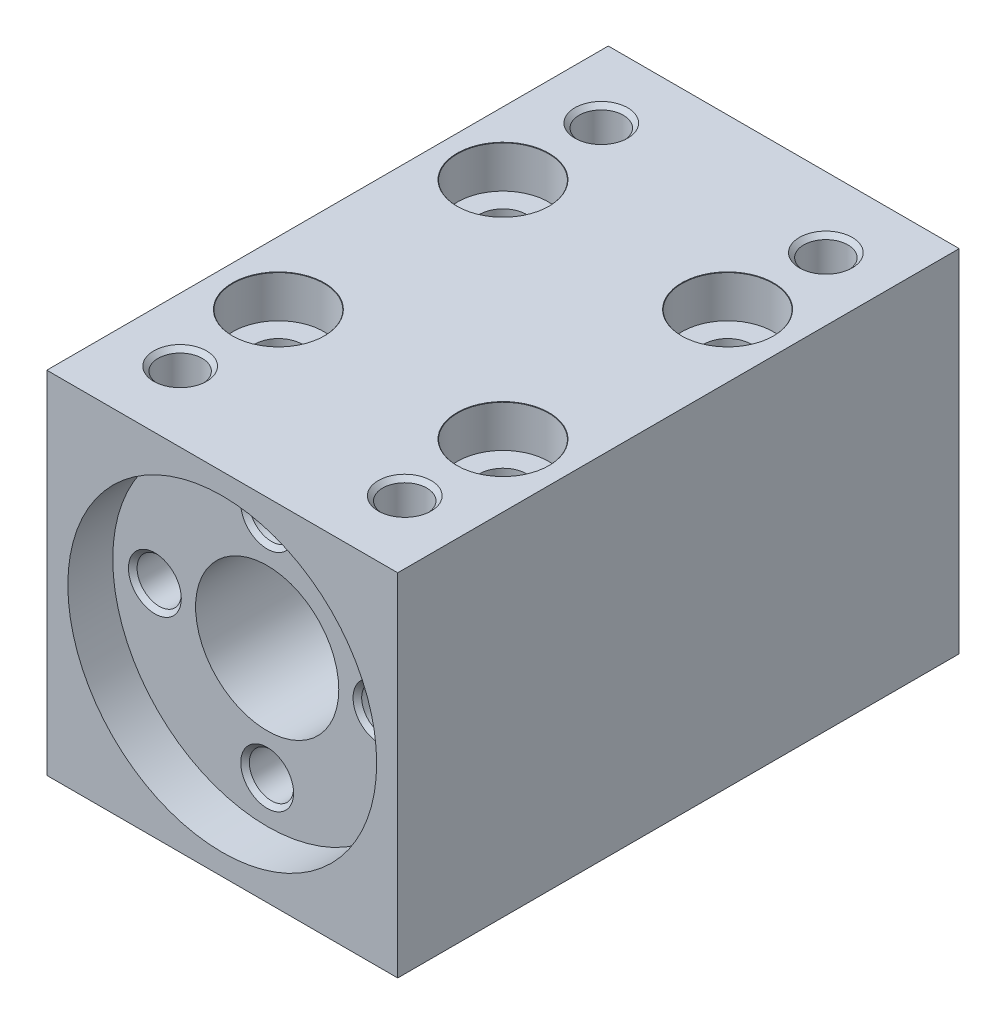
ISO-10303-21;
HEADER;
FILE_DESCRIPTION(('STEP AP214'),'2;1');
FILE_NAME('part.step','',(''),(''),'','','');
FILE_SCHEMA(('AUTOMOTIVE_DESIGN { 1 0 10303 214 1 1 1 1 }'));
ENDSEC;
DATA;
#1=APPLICATION_CONTEXT('core data for automotive mechanical design processes');
#2=APPLICATION_PROTOCOL_DEFINITION('international standard','automotive_design',2000,#1);
#3=PRODUCT_CONTEXT('',#1,'mechanical');
#4=PRODUCT('Part','Part','',(#3));
#5=PRODUCT_RELATED_PRODUCT_CATEGORY('part','',(#4));
#6=PRODUCT_DEFINITION_FORMATION('','',#4);
#7=PRODUCT_DEFINITION_CONTEXT('part definition',#1,'design');
#8=PRODUCT_DEFINITION('design','',#6,#7);
#9=PRODUCT_DEFINITION_SHAPE('','',#8);
#10=(LENGTH_UNIT() NAMED_UNIT(*) SI_UNIT(.MILLI.,.METRE.));
#11=(NAMED_UNIT(*) PLANE_ANGLE_UNIT() SI_UNIT($,.RADIAN.));
#12=(NAMED_UNIT(*) SI_UNIT($,.STERADIAN.) SOLID_ANGLE_UNIT());
#13=UNCERTAINTY_MEASURE_WITH_UNIT(LENGTH_MEASURE(1.E-05),#10,'distance_accuracy_value','');
#14=(GEOMETRIC_REPRESENTATION_CONTEXT(3) GLOBAL_UNCERTAINTY_ASSIGNED_CONTEXT((#13)) GLOBAL_UNIT_ASSIGNED_CONTEXT((#10,
#11,#12)) REPRESENTATION_CONTEXT('',''));
#15=CARTESIAN_POINT('',(0.,0.,0.));
#16=DIRECTION('',(0.,0.,1.));
#17=DIRECTION('',(1.,0.,0.));
#18=AXIS2_PLACEMENT_3D('',#15,#16,#17);
#19=CARTESIAN_POINT('',(0.,0.,0.));
#20=DIRECTION('',(0.,0.,1.));
#21=DIRECTION('',(1.,0.,0.));
#22=AXIS2_PLACEMENT_3D('',#19,#20,#21);
#23=CYLINDRICAL_SURFACE('',#22,5.1);
#24=CARTESIAN_POINT('',(0.,0.,0.));
#25=DIRECTION('',(0.,0.,1.));
#26=DIRECTION('',(1.,0.,0.));
#27=AXIS2_PLACEMENT_3D('',#24,#25,#26);
#28=CIRCLE('',#27,5.1);
#29=CARTESIAN_POINT('',(5.1,0.,0.));
#30=VERTEX_POINT('',#29);
#31=EDGE_CURVE('E308',#30,#30,#28,.T.);
#32=ORIENTED_EDGE('',*,*,#31,.F.);
#33=EDGE_LOOP('',(#32));
#34=FACE_BOUND('',#33,.T.);
#35=CARTESIAN_POINT('',(0.,0.,36.8));
#36=DIRECTION('',(0.,0.,1.));
#37=DIRECTION('',(1.,0.,0.));
#38=AXIS2_PLACEMENT_3D('',#35,#36,#37);
#39=CIRCLE('',#38,5.1);
#40=CARTESIAN_POINT('',(5.1,0.,36.8));
#41=VERTEX_POINT('',#40);
#42=EDGE_CURVE('E46',#41,#41,#39,.F.);
#43=ORIENTED_EDGE('',*,*,#42,.F.);
#44=EDGE_LOOP('',(#43));
#45=FACE_BOUND('',#44,.T.);
#46=ADVANCED_FACE('F42',(#34,#45),#23,.F.);
#47=CARTESIAN_POINT('',(-12.5,-12.5,40.));
#48=DIRECTION('',(1.,0.,0.));
#49=DIRECTION('',(0.,0.,-1.));
#50=AXIS2_PLACEMENT_3D('',#47,#48,#49);
#51=PLANE('',#50);
#52=DIRECTION('',(0.,-1.,0.));
#53=VECTOR('',#52,1.);
#54=CARTESIAN_POINT('',(-12.5,-12.5,0.));
#55=LINE('',#54,#53);
#56=CARTESIAN_POINT('',(-12.5,12.5,0.));
#57=VERTEX_POINT('',#56);
#58=CARTESIAN_POINT('',(-12.5,-12.5,0.));
#59=VERTEX_POINT('',#58);
#60=EDGE_CURVE('E312',#57,#59,#55,.T.);
#61=ORIENTED_EDGE('',*,*,#60,.T.);
#62=DIRECTION('',(0.,0.,-1.));
#63=VECTOR('',#62,1.);
#64=CARTESIAN_POINT('',(-12.5,-12.5,40.));
#65=LINE('',#64,#63);
#66=CARTESIAN_POINT('',(-12.5,-12.5,40.));
#67=VERTEX_POINT('',#66);
#68=EDGE_CURVE('E11',#67,#59,#65,.T.);
#69=ORIENTED_EDGE('',*,*,#68,.F.);
#70=DIRECTION('',(0.,-1.,0.));
#71=VECTOR('',#70,1.);
#72=CARTESIAN_POINT('',(-12.5,-12.5,40.));
#73=LINE('',#72,#71);
#74=CARTESIAN_POINT('',(-12.5,12.5,40.));
#75=VERTEX_POINT('',#74);
#76=EDGE_CURVE('E313',#75,#67,#73,.T.);
#77=ORIENTED_EDGE('',*,*,#76,.F.);
#78=DIRECTION('',(0.,0.,-1.));
#79=VECTOR('',#78,1.);
#80=CARTESIAN_POINT('',(-12.5,12.5,40.));
#81=LINE('',#80,#79);
#82=EDGE_CURVE('E323',#75,#57,#81,.T.);
#83=ORIENTED_EDGE('',*,*,#82,.T.);
#84=EDGE_LOOP('',(#61,#69,#77,#83));
#85=FACE_BOUND('',#84,.T.);
#86=ADVANCED_FACE('F44',(#85),#51,.F.);
#87=CARTESIAN_POINT('',(12.5,-12.5,40.));
#88=DIRECTION('',(0.,1.,0.));
#89=DIRECTION('',(-1.,0.,0.));
#90=AXIS2_PLACEMENT_3D('',#87,#88,#89);
#91=PLANE('',#90);
#92=CARTESIAN_POINT('',(-8.,-12.5,12.));
#93=DIRECTION('',(0.,1.,0.));
#94=DIRECTION('',(0.,0.,1.));
#95=AXIS2_PLACEMENT_3D('',#92,#93,#94);
#96=CIRCLE('',#95,1.69999999999999);
#97=CARTESIAN_POINT('',(-8.,-12.5,13.7));
#98=VERTEX_POINT('',#97);
#99=EDGE_CURVE('E188',#98,#98,#96,.T.);
#100=ORIENTED_EDGE('',*,*,#99,.T.);
#101=EDGE_LOOP('',(#100));
#102=FACE_BOUND('',#101,.T.);
#103=CARTESIAN_POINT('',(8.,-12.5,12.));
#104=DIRECTION('',(0.,1.,0.));
#105=DIRECTION('',(0.,0.,1.));
#106=AXIS2_PLACEMENT_3D('',#103,#104,#105);
#107=CIRCLE('',#106,1.69999999999999);
#108=CARTESIAN_POINT('',(8.,-12.5,13.7));
#109=VERTEX_POINT('',#108);
#110=EDGE_CURVE('E208',#109,#109,#107,.T.);
#111=ORIENTED_EDGE('',*,*,#110,.T.);
#112=EDGE_LOOP('',(#111));
#113=FACE_BOUND('',#112,.T.);
#114=CARTESIAN_POINT('',(-8.,-12.5,28.));
#115=DIRECTION('',(0.,1.,0.));
#116=DIRECTION('',(0.,0.,1.));
#117=AXIS2_PLACEMENT_3D('',#114,#115,#116);
#118=CIRCLE('',#117,1.69999999999999);
#119=CARTESIAN_POINT('',(-8.,-12.5,29.7));
#120=VERTEX_POINT('',#119);
#121=EDGE_CURVE('E228',#120,#120,#118,.T.);
#122=ORIENTED_EDGE('',*,*,#121,.T.);
#123=EDGE_LOOP('',(#122));
#124=FACE_BOUND('',#123,.T.);
#125=CARTESIAN_POINT('',(8.,-12.5,28.));
#126=DIRECTION('',(0.,1.,0.));
#127=DIRECTION('',(0.,0.,1.));
#128=AXIS2_PLACEMENT_3D('',#125,#126,#127);
#129=CIRCLE('',#128,1.69999999999999);
#130=CARTESIAN_POINT('',(8.,-12.5,29.7));
#131=VERTEX_POINT('',#130);
#132=EDGE_CURVE('E248',#131,#131,#129,.T.);
#133=ORIENTED_EDGE('',*,*,#132,.T.);
#134=EDGE_LOOP('',(#133));
#135=FACE_BOUND('',#134,.T.);
#136=DIRECTION('',(1.,0.,0.));
#137=VECTOR('',#136,1.);
#138=CARTESIAN_POINT('',(12.5,-12.5,0.));
#139=LINE('',#138,#137);
#140=CARTESIAN_POINT('',(12.5,-12.5,0.));
#141=VERTEX_POINT('',#140);
#142=EDGE_CURVE('E327',#59,#141,#139,.T.);
#143=ORIENTED_EDGE('',*,*,#142,.T.);
#144=DIRECTION('',(0.,0.,-1.));
#145=VECTOR('',#144,1.);
#146=CARTESIAN_POINT('',(12.5,-12.5,40.));
#147=LINE('',#146,#145);
#148=CARTESIAN_POINT('',(12.5,-12.5,40.));
#149=VERTEX_POINT('',#148);
#150=EDGE_CURVE('E53',#149,#141,#147,.T.);
#151=ORIENTED_EDGE('',*,*,#150,.F.);
#152=DIRECTION('',(1.,0.,0.));
#153=VECTOR('',#152,1.);
#154=CARTESIAN_POINT('',(12.5,-12.5,40.));
#155=LINE('',#154,#153);
#156=EDGE_CURVE('E92',#67,#149,#155,.T.);
#157=ORIENTED_EDGE('',*,*,#156,.F.);
#158=ORIENTED_EDGE('',*,*,#68,.T.);
#159=EDGE_LOOP('',(#143,#151,#157,#158));
#160=FACE_BOUND('',#159,.T.);
#161=ADVANCED_FACE('F361',(#102,#113,#124,#135,#160),#91,.F.);
#162=CARTESIAN_POINT('',(12.5,-12.5,40.));
#163=DIRECTION('',(-1.,0.,0.));
#164=DIRECTION('',(0.,0.,1.));
#165=AXIS2_PLACEMENT_3D('',#162,#163,#164);
#166=PLANE('',#165);
#167=DIRECTION('',(0.,1.,0.));
#168=VECTOR('',#167,1.);
#169=CARTESIAN_POINT('',(12.5,-12.5,0.));
#170=LINE('',#169,#168);
#171=CARTESIAN_POINT('',(12.5,12.5,0.));
#172=VERTEX_POINT('',#171);
#173=EDGE_CURVE('E79',#141,#172,#170,.T.);
#174=ORIENTED_EDGE('',*,*,#173,.T.);
#175=DIRECTION('',(0.,0.,-1.));
#176=VECTOR('',#175,1.);
#177=CARTESIAN_POINT('',(12.5,12.5,40.));
#178=LINE('',#177,#176);
#179=CARTESIAN_POINT('',(12.5,12.5,40.));
#180=VERTEX_POINT('',#179);
#181=EDGE_CURVE('E336',#180,#172,#178,.T.);
#182=ORIENTED_EDGE('',*,*,#181,.F.);
#183=DIRECTION('',(0.,1.,0.));
#184=VECTOR('',#183,1.);
#185=CARTESIAN_POINT('',(12.5,-12.5,40.));
#186=LINE('',#185,#184);
#187=EDGE_CURVE('E318',#149,#180,#186,.T.);
#188=ORIENTED_EDGE('',*,*,#187,.F.);
#189=ORIENTED_EDGE('',*,*,#150,.T.);
#190=EDGE_LOOP('',(#174,#182,#188,#189));
#191=FACE_BOUND('',#190,.T.);
#192=ADVANCED_FACE('F341',(#191),#166,.F.);
#193=CARTESIAN_POINT('',(12.5,12.5,40.));
#194=DIRECTION('',(0.,-1.,0.));
#195=DIRECTION('',(1.,0.,0.));
#196=AXIS2_PLACEMENT_3D('',#193,#194,#195);
#197=PLANE('',#196);
#198=CARTESIAN_POINT('',(-8.00000000000001,12.5,5.));
#199=DIRECTION('',(0.,1.,0.));
#200=DIRECTION('',(0.,0.,1.));
#201=AXIS2_PLACEMENT_3D('',#198,#199,#200);
#202=CIRCLE('',#201,1.883);
#203=CARTESIAN_POINT('',(-8.00000000000001,12.5,6.883));
#204=VERTEX_POINT('',#203);
#205=EDGE_CURVE('E137',#204,#204,#202,.T.);
#206=ORIENTED_EDGE('',*,*,#205,.F.);
#207=EDGE_LOOP('',(#206));
#208=FACE_BOUND('',#207,.T.);
#209=CARTESIAN_POINT('',(8.,12.5,5.));
#210=DIRECTION('',(0.,1.,0.));
#211=DIRECTION('',(0.,0.,1.));
#212=AXIS2_PLACEMENT_3D('',#209,#210,#211);
#213=CIRCLE('',#212,1.883);
#214=CARTESIAN_POINT('',(8.,12.5,6.883));
#215=VERTEX_POINT('',#214);
#216=EDGE_CURVE('E128',#215,#215,#213,.T.);
#217=ORIENTED_EDGE('',*,*,#216,.F.);
#218=EDGE_LOOP('',(#217));
#219=FACE_BOUND('',#218,.T.);
#220=CARTESIAN_POINT('',(-8.,12.5,35.));
#221=DIRECTION('',(0.,1.,0.));
#222=DIRECTION('',(0.,0.,1.));
#223=AXIS2_PLACEMENT_3D('',#220,#221,#222);
#224=CIRCLE('',#223,1.883);
#225=CARTESIAN_POINT('',(-8.,12.5,36.883));
#226=VERTEX_POINT('',#225);
#227=EDGE_CURVE('E148',#226,#226,#224,.T.);
#228=ORIENTED_EDGE('',*,*,#227,.F.);
#229=EDGE_LOOP('',(#228));
#230=FACE_BOUND('',#229,.T.);
#231=CARTESIAN_POINT('',(8.,12.5,35.));
#232=DIRECTION('',(0.,1.,0.));
#233=DIRECTION('',(0.,0.,1.));
#234=AXIS2_PLACEMENT_3D('',#231,#232,#233);
#235=CIRCLE('',#234,1.883);
#236=CARTESIAN_POINT('',(8.,12.5,36.883));
#237=VERTEX_POINT('',#236);
#238=EDGE_CURVE('E160',#237,#237,#235,.T.);
#239=ORIENTED_EDGE('',*,*,#238,.F.);
#240=EDGE_LOOP('',(#239));
#241=FACE_BOUND('',#240,.T.);
#242=CARTESIAN_POINT('',(-8.,12.5,12.));
#243=DIRECTION('',(0.,1.,0.));
#244=DIRECTION('',(0.,0.,1.));
#245=AXIS2_PLACEMENT_3D('',#242,#243,#244);
#246=CIRCLE('',#245,3.275);
#247=CARTESIAN_POINT('',(-8.,12.5,15.275));
#248=VERTEX_POINT('',#247);
#249=EDGE_CURVE('E172',#248,#248,#246,.T.);
#250=ORIENTED_EDGE('',*,*,#249,.F.);
#251=EDGE_LOOP('',(#250));
#252=FACE_BOUND('',#251,.T.);
#253=CARTESIAN_POINT('',(8.,12.5,12.));
#254=DIRECTION('',(0.,1.,0.));
#255=DIRECTION('',(0.,0.,1.));
#256=AXIS2_PLACEMENT_3D('',#253,#254,#255);
#257=CIRCLE('',#256,3.275);
#258=CARTESIAN_POINT('',(8.,12.5,15.275));
#259=VERTEX_POINT('',#258);
#260=EDGE_CURVE('E192',#259,#259,#257,.T.);
#261=ORIENTED_EDGE('',*,*,#260,.F.);
#262=EDGE_LOOP('',(#261));
#263=FACE_BOUND('',#262,.T.);
#264=CARTESIAN_POINT('',(-8.,12.5,28.));
#265=DIRECTION('',(0.,1.,0.));
#266=DIRECTION('',(0.,0.,1.));
#267=AXIS2_PLACEMENT_3D('',#264,#265,#266);
#268=CIRCLE('',#267,3.275);
#269=CARTESIAN_POINT('',(-8.,12.5,31.275));
#270=VERTEX_POINT('',#269);
#271=EDGE_CURVE('E212',#270,#270,#268,.T.);
#272=ORIENTED_EDGE('',*,*,#271,.F.);
#273=EDGE_LOOP('',(#272));
#274=FACE_BOUND('',#273,.T.);
#275=CARTESIAN_POINT('',(8.,12.5,28.));
#276=DIRECTION('',(0.,1.,0.));
#277=DIRECTION('',(0.,0.,1.));
#278=AXIS2_PLACEMENT_3D('',#275,#276,#277);
#279=CIRCLE('',#278,3.275);
#280=CARTESIAN_POINT('',(8.,12.5,31.275));
#281=VERTEX_POINT('',#280);
#282=EDGE_CURVE('E232',#281,#281,#279,.T.);
#283=ORIENTED_EDGE('',*,*,#282,.F.);
#284=EDGE_LOOP('',(#283));
#285=FACE_BOUND('',#284,.T.);
#286=DIRECTION('',(-1.,0.,0.));
#287=VECTOR('',#286,1.);
#288=CARTESIAN_POINT('',(12.5,12.5,0.));
#289=LINE('',#288,#287);
#290=EDGE_CURVE('E85',#172,#57,#289,.T.);
#291=ORIENTED_EDGE('',*,*,#290,.T.);
#292=ORIENTED_EDGE('',*,*,#82,.F.);
#293=DIRECTION('',(-1.,0.,0.));
#294=VECTOR('',#293,1.);
#295=CARTESIAN_POINT('',(12.5,12.5,40.));
#296=LINE('',#295,#294);
#297=EDGE_CURVE('E61',#180,#75,#296,.T.);
#298=ORIENTED_EDGE('',*,*,#297,.F.);
#299=ORIENTED_EDGE('',*,*,#181,.T.);
#300=EDGE_LOOP('',(#291,#292,#298,#299));
#301=FACE_BOUND('',#300,.T.);
#302=ADVANCED_FACE('F348',(#208,#219,#230,#241,#252,#263,#274,#285,#301),#197,.F.);
#303=CARTESIAN_POINT('',(0.,0.,40.));
#304=DIRECTION('',(0.,0.,1.));
#305=DIRECTION('',(1.,0.,0.));
#306=AXIS2_PLACEMENT_3D('',#303,#304,#305);
#307=PLANE('',#306);
#308=CARTESIAN_POINT('',(0.,0.,40.));
#309=DIRECTION('',(0.,0.,1.));
#310=DIRECTION('',(1.,0.,0.));
#311=AXIS2_PLACEMENT_3D('',#308,#309,#310);
#312=CIRCLE('',#311,11.);
#313=CARTESIAN_POINT('',(11.,0.,40.));
#314=VERTEX_POINT('',#313);
#315=EDGE_CURVE('E300',#314,#314,#312,.T.);
#316=ORIENTED_EDGE('',*,*,#315,.F.);
#317=EDGE_LOOP('',(#316));
#318=FACE_BOUND('',#317,.T.);
#319=ORIENTED_EDGE('',*,*,#76,.T.);
#320=ORIENTED_EDGE('',*,*,#156,.T.);
#321=ORIENTED_EDGE('',*,*,#187,.T.);
#322=ORIENTED_EDGE('',*,*,#297,.T.);
#323=EDGE_LOOP('',(#319,#320,#321,#322));
#324=FACE_BOUND('',#323,.T.);
#325=ADVANCED_FACE('F350',(#318,#324),#307,.T.);
#326=CARTESIAN_POINT('',(0.,0.,0.));
#327=DIRECTION('',(0.,0.,1.));
#328=DIRECTION('',(1.,0.,0.));
#329=AXIS2_PLACEMENT_3D('',#326,#327,#328);
#330=PLANE('',#329);
#331=ORIENTED_EDGE('',*,*,#31,.T.);
#332=EDGE_LOOP('',(#331));
#333=FACE_BOUND('',#332,.T.);
#334=ORIENTED_EDGE('',*,*,#60,.F.);
#335=ORIENTED_EDGE('',*,*,#290,.F.);
#336=ORIENTED_EDGE('',*,*,#173,.F.);
#337=ORIENTED_EDGE('',*,*,#142,.F.);
#338=EDGE_LOOP('',(#334,#335,#336,#337));
#339=FACE_BOUND('',#338,.T.);
#340=ADVANCED_FACE('F344',(#333,#339),#330,.F.);
#341=CARTESIAN_POINT('',(0.,0.,36.8));
#342=DIRECTION('',(0.,0.,1.));
#343=DIRECTION('',(1.,0.,0.));
#344=AXIS2_PLACEMENT_3D('',#341,#342,#343);
#345=PLANE('',#344);
#346=CARTESIAN_POINT('',(0.,8.,36.8));
#347=DIRECTION('',(0.,0.,1.));
#348=DIRECTION('',(1.,0.,0.));
#349=AXIS2_PLACEMENT_3D('',#346,#347,#348);
#350=CIRCLE('',#349,1.883);
#351=CARTESIAN_POINT('',(1.883,8.,36.8));
#352=VERTEX_POINT('',#351);
#353=EDGE_CURVE('E252',#352,#352,#350,.T.);
#354=ORIENTED_EDGE('',*,*,#353,.F.);
#355=EDGE_LOOP('',(#354));
#356=FACE_BOUND('',#355,.T.);
#357=CARTESIAN_POINT('',(8.00000000000023,2.25904099284255E-13,36.8));
#358=DIRECTION('',(0.,0.,1.));
#359=DIRECTION('',(1.,0.,0.));
#360=AXIS2_PLACEMENT_3D('',#357,#358,#359);
#361=CIRCLE('',#360,1.883);
#362=CARTESIAN_POINT('',(9.88300000000022,2.25904099284255E-13,36.8));
#363=VERTEX_POINT('',#362);
#364=EDGE_CURVE('E264',#363,#363,#361,.T.);
#365=ORIENTED_EDGE('',*,*,#364,.F.);
#366=EDGE_LOOP('',(#365));
#367=FACE_BOUND('',#366,.T.);
#368=CARTESIAN_POINT('',(4.51808198568511E-13,-8.,36.8));
#369=DIRECTION('',(0.,0.,1.));
#370=DIRECTION('',(1.,0.,0.));
#371=AXIS2_PLACEMENT_3D('',#368,#369,#370);
#372=CIRCLE('',#371,1.883);
#373=CARTESIAN_POINT('',(1.88300000000045,-8.,36.8));
#374=VERTEX_POINT('',#373);
#375=EDGE_CURVE('E276',#374,#374,#372,.T.);
#376=ORIENTED_EDGE('',*,*,#375,.F.);
#377=EDGE_LOOP('',(#376));
#378=FACE_BOUND('',#377,.T.);
#379=CARTESIAN_POINT('',(-7.99999999999977,-2.24924381844937E-13,36.8));
#380=DIRECTION('',(0.,0.,1.));
#381=DIRECTION('',(1.,0.,0.));
#382=AXIS2_PLACEMENT_3D('',#379,#380,#381);
#383=CIRCLE('',#382,1.883);
#384=CARTESIAN_POINT('',(-6.11699999999978,-2.24924381844937E-13,36.8));
#385=VERTEX_POINT('',#384);
#386=EDGE_CURVE('E288',#385,#385,#383,.T.);
#387=ORIENTED_EDGE('',*,*,#386,.F.);
#388=EDGE_LOOP('',(#387));
#389=FACE_BOUND('',#388,.T.);
#390=CARTESIAN_POINT('',(0.,0.,36.8));
#391=DIRECTION('',(0.,0.,1.));
#392=DIRECTION('',(1.,0.,0.));
#393=AXIS2_PLACEMENT_3D('',#390,#391,#392);
#394=CIRCLE('',#393,11.);
#395=CARTESIAN_POINT('',(11.,0.,36.8));
#396=VERTEX_POINT('',#395);
#397=EDGE_CURVE('E301',#396,#396,#394,.T.);
#398=ORIENTED_EDGE('',*,*,#397,.T.);
#399=EDGE_LOOP('',(#398));
#400=FACE_BOUND('',#399,.T.);
#401=ORIENTED_EDGE('',*,*,#42,.T.);
#402=EDGE_LOOP('',(#401));
#403=FACE_BOUND('',#402,.T.);
#404=ADVANCED_FACE('F378',(#356,#367,#378,#389,#400,#403),#345,.T.);
#405=CARTESIAN_POINT('',(0.,0.,36.8));
#406=DIRECTION('',(0.,0.,1.));
#407=DIRECTION('',(1.,0.,0.));
#408=AXIS2_PLACEMENT_3D('',#405,#406,#407);
#409=CYLINDRICAL_SURFACE('',#408,11.);
#410=ORIENTED_EDGE('',*,*,#397,.F.);
#411=EDGE_LOOP('',(#410));
#412=FACE_BOUND('',#411,.T.);
#413=ORIENTED_EDGE('',*,*,#315,.T.);
#414=EDGE_LOOP('',(#413));
#415=FACE_BOUND('',#414,.T.);
#416=ADVANCED_FACE('F375',(#412,#415),#409,.F.);
#417=CARTESIAN_POINT('',(-7.99999999999977,-2.24924381844937E-13,30.8));
#418=DIRECTION('',(0.,0.,1.));
#419=DIRECTION('',(1.,0.,0.));
#420=AXIS2_PLACEMENT_3D('',#417,#418,#419);
#421=CONICAL_SURFACE('',#420,1.575,1.02974425867665);
#422=CARTESIAN_POINT('',(-7.99999999999978,-2.24924381844937E-13,29.8536445250316));
#423=VERTEX_POINT('',#422);
#424=VERTEX_LOOP('',#423);
#425=FACE_BOUND('',#424,.T.);
#426=CARTESIAN_POINT('',(-7.99999999999977,-2.24924381844937E-13,30.8));
#427=DIRECTION('',(0.,0.,1.));
#428=DIRECTION('',(1.,0.,0.));
#429=AXIS2_PLACEMENT_3D('',#426,#427,#428);
#430=CIRCLE('',#429,1.575);
#431=CARTESIAN_POINT('',(-6.42499999999978,-2.24924381844937E-13,30.8));
#432=VERTEX_POINT('',#431);
#433=EDGE_CURVE('E296',#432,#432,#430,.T.);
#434=ORIENTED_EDGE('',*,*,#433,.T.);
#435=EDGE_LOOP('',(#434));
#436=FACE_BOUND('',#435,.T.);
#437=ADVANCED_FACE('F387',(#425,#436),#421,.F.);
#438=CARTESIAN_POINT('',(-7.99999999999977,-2.24924381844937E-13,36.8));
#439=DIRECTION('',(0.,0.,1.));
#440=DIRECTION('',(1.,0.,0.));
#441=AXIS2_PLACEMENT_3D('',#438,#439,#440);
#442=CYLINDRICAL_SURFACE('',#441,1.57499999999999);
#443=ORIENTED_EDGE('',*,*,#433,.F.);
#444=EDGE_LOOP('',(#443));
#445=FACE_BOUND('',#444,.T.);
#446=CARTESIAN_POINT('',(-7.99999999999977,-2.24924381844937E-13,36.492));
#447=DIRECTION('',(0.,0.,1.));
#448=DIRECTION('',(1.,0.,0.));
#449=AXIS2_PLACEMENT_3D('',#446,#447,#448);
#450=CIRCLE('',#449,1.57499999999999);
#451=CARTESIAN_POINT('',(-6.42499999999978,-2.24924381844937E-13,36.492));
#452=VERTEX_POINT('',#451);
#453=EDGE_CURVE('E292',#452,#452,#450,.T.);
#454=ORIENTED_EDGE('',*,*,#453,.T.);
#455=EDGE_LOOP('',(#454));
#456=FACE_BOUND('',#455,.T.);
#457=ADVANCED_FACE('F394',(#445,#456),#442,.F.);
#458=CARTESIAN_POINT('',(-7.99999999999977,-2.24924381844937E-13,36.8));
#459=DIRECTION('',(0.,0.,1.));
#460=DIRECTION('',(1.,0.,0.));
#461=AXIS2_PLACEMENT_3D('',#458,#459,#460);
#462=CONICAL_SURFACE('',#461,1.883,0.78539816339746);
#463=ORIENTED_EDGE('',*,*,#453,.F.);
#464=EDGE_LOOP('',(#463));
#465=FACE_BOUND('',#464,.T.);
#466=ORIENTED_EDGE('',*,*,#386,.T.);
#467=EDGE_LOOP('',(#466));
#468=FACE_BOUND('',#467,.T.);
#469=ADVANCED_FACE('F398',(#465,#468),#462,.F.);
#470=CARTESIAN_POINT('',(4.51808198568511E-13,-8.,30.8));
#471=DIRECTION('',(0.,0.,1.));
#472=DIRECTION('',(1.,0.,0.));
#473=AXIS2_PLACEMENT_3D('',#470,#471,#472);
#474=CONICAL_SURFACE('',#473,1.575,1.02974425867665);
#475=CARTESIAN_POINT('',(4.50106832168879E-13,-8.,29.8536445250316));
#476=VERTEX_POINT('',#475);
#477=VERTEX_LOOP('',#476);
#478=FACE_BOUND('',#477,.T.);
#479=CARTESIAN_POINT('',(4.51808198568511E-13,-8.,30.8));
#480=DIRECTION('',(0.,0.,1.));
#481=DIRECTION('',(1.,0.,0.));
#482=AXIS2_PLACEMENT_3D('',#479,#480,#481);
#483=CIRCLE('',#482,1.575);
#484=CARTESIAN_POINT('',(1.57500000000045,-8.,30.8));
#485=VERTEX_POINT('',#484);
#486=EDGE_CURVE('E284',#485,#485,#483,.T.);
#487=ORIENTED_EDGE('',*,*,#486,.T.);
#488=EDGE_LOOP('',(#487));
#489=FACE_BOUND('',#488,.T.);
#490=ADVANCED_FACE('F402',(#478,#489),#474,.F.);
#491=CARTESIAN_POINT('',(4.51808198568511E-13,-8.,36.8));
#492=DIRECTION('',(0.,0.,1.));
#493=DIRECTION('',(1.,0.,0.));
#494=AXIS2_PLACEMENT_3D('',#491,#492,#493);
#495=CYLINDRICAL_SURFACE('',#494,1.57499999999999);
#496=ORIENTED_EDGE('',*,*,#486,.F.);
#497=EDGE_LOOP('',(#496));
#498=FACE_BOUND('',#497,.T.);
#499=CARTESIAN_POINT('',(4.51808198568511E-13,-8.,36.492));
#500=DIRECTION('',(0.,0.,1.));
#501=DIRECTION('',(1.,0.,0.));
#502=AXIS2_PLACEMENT_3D('',#499,#500,#501);
#503=CIRCLE('',#502,1.57499999999999);
#504=CARTESIAN_POINT('',(1.57500000000044,-8.,36.492));
#505=VERTEX_POINT('',#504);
#506=EDGE_CURVE('E280',#505,#505,#503,.T.);
#507=ORIENTED_EDGE('',*,*,#506,.T.);
#508=EDGE_LOOP('',(#507));
#509=FACE_BOUND('',#508,.T.);
#510=ADVANCED_FACE('F406',(#498,#509),#495,.F.);
#511=CARTESIAN_POINT('',(4.51808198568511E-13,-8.,36.8));
#512=DIRECTION('',(0.,0.,1.));
#513=DIRECTION('',(1.,0.,0.));
#514=AXIS2_PLACEMENT_3D('',#511,#512,#513);
#515=CONICAL_SURFACE('',#514,1.883,0.78539816339746);
#516=ORIENTED_EDGE('',*,*,#506,.F.);
#517=EDGE_LOOP('',(#516));
#518=FACE_BOUND('',#517,.T.);
#519=ORIENTED_EDGE('',*,*,#375,.T.);
#520=EDGE_LOOP('',(#519));
#521=FACE_BOUND('',#520,.T.);
#522=ADVANCED_FACE('F410',(#518,#521),#515,.F.);
#523=CARTESIAN_POINT('',(8.00000000000023,2.25904099284255E-13,30.8));
#524=DIRECTION('',(0.,0.,1.));
#525=DIRECTION('',(1.,0.,0.));
#526=AXIS2_PLACEMENT_3D('',#523,#524,#525);
#527=CONICAL_SURFACE('',#526,1.575,1.02974425867665);
#528=CARTESIAN_POINT('',(8.00000000000022,2.25904099284255E-13,29.8536445250316));
#529=VERTEX_POINT('',#528);
#530=VERTEX_LOOP('',#529);
#531=FACE_BOUND('',#530,.T.);
#532=CARTESIAN_POINT('',(8.00000000000023,2.25904099284255E-13,30.8));
#533=DIRECTION('',(0.,0.,1.));
#534=DIRECTION('',(1.,0.,0.));
#535=AXIS2_PLACEMENT_3D('',#532,#533,#534);
#536=CIRCLE('',#535,1.575);
#537=CARTESIAN_POINT('',(9.57500000000022,2.25904099284255E-13,30.8));
#538=VERTEX_POINT('',#537);
#539=EDGE_CURVE('E272',#538,#538,#536,.T.);
#540=ORIENTED_EDGE('',*,*,#539,.T.);
#541=EDGE_LOOP('',(#540));
#542=FACE_BOUND('',#541,.T.);
#543=ADVANCED_FACE('F414',(#531,#542),#527,.F.);
#544=CARTESIAN_POINT('',(8.00000000000023,2.25904099284255E-13,36.8));
#545=DIRECTION('',(0.,0.,1.));
#546=DIRECTION('',(1.,0.,0.));
#547=AXIS2_PLACEMENT_3D('',#544,#545,#546);
#548=CYLINDRICAL_SURFACE('',#547,1.57499999999999);
#549=ORIENTED_EDGE('',*,*,#539,.F.);
#550=EDGE_LOOP('',(#549));
#551=FACE_BOUND('',#550,.T.);
#552=CARTESIAN_POINT('',(8.00000000000023,2.25904099284255E-13,36.492));
#553=DIRECTION('',(0.,0.,1.));
#554=DIRECTION('',(1.,0.,0.));
#555=AXIS2_PLACEMENT_3D('',#552,#553,#554);
#556=CIRCLE('',#555,1.57499999999999);
#557=CARTESIAN_POINT('',(9.57500000000022,2.25904099284255E-13,36.492));
#558=VERTEX_POINT('',#557);
#559=EDGE_CURVE('E268',#558,#558,#556,.T.);
#560=ORIENTED_EDGE('',*,*,#559,.T.);
#561=EDGE_LOOP('',(#560));
#562=FACE_BOUND('',#561,.T.);
#563=ADVANCED_FACE('F418',(#551,#562),#548,.F.);
#564=CARTESIAN_POINT('',(8.00000000000023,2.25904099284255E-13,36.8));
#565=DIRECTION('',(0.,0.,1.));
#566=DIRECTION('',(1.,0.,0.));
#567=AXIS2_PLACEMENT_3D('',#564,#565,#566);
#568=CONICAL_SURFACE('',#567,1.883,0.78539816339746);
#569=ORIENTED_EDGE('',*,*,#559,.F.);
#570=EDGE_LOOP('',(#569));
#571=FACE_BOUND('',#570,.T.);
#572=ORIENTED_EDGE('',*,*,#364,.T.);
#573=EDGE_LOOP('',(#572));
#574=FACE_BOUND('',#573,.T.);
#575=ADVANCED_FACE('F422',(#571,#574),#568,.F.);
#576=CARTESIAN_POINT('',(0.,8.,30.8));
#577=DIRECTION('',(0.,0.,1.));
#578=DIRECTION('',(1.,0.,0.));
#579=AXIS2_PLACEMENT_3D('',#576,#577,#578);
#580=CONICAL_SURFACE('',#579,1.575,1.02974425867665);
#581=CARTESIAN_POINT('',(0.,8.,29.8536445250316));
#582=VERTEX_POINT('',#581);
#583=VERTEX_LOOP('',#582);
#584=FACE_BOUND('',#583,.T.);
#585=CARTESIAN_POINT('',(0.,8.,30.8));
#586=DIRECTION('',(0.,0.,1.));
#587=DIRECTION('',(1.,0.,0.));
#588=AXIS2_PLACEMENT_3D('',#585,#586,#587);
#589=CIRCLE('',#588,1.575);
#590=CARTESIAN_POINT('',(1.575,8.,30.8));
#591=VERTEX_POINT('',#590);
#592=EDGE_CURVE('E260',#591,#591,#589,.T.);
#593=ORIENTED_EDGE('',*,*,#592,.T.);
#594=EDGE_LOOP('',(#593));
#595=FACE_BOUND('',#594,.T.);
#596=ADVANCED_FACE('F426',(#584,#595),#580,.F.);
#597=CARTESIAN_POINT('',(0.,8.,36.8));
#598=DIRECTION('',(0.,0.,1.));
#599=DIRECTION('',(1.,0.,0.));
#600=AXIS2_PLACEMENT_3D('',#597,#598,#599);
#601=CYLINDRICAL_SURFACE('',#600,1.57499999999999);
#602=ORIENTED_EDGE('',*,*,#592,.F.);
#603=EDGE_LOOP('',(#602));
#604=FACE_BOUND('',#603,.T.);
#605=CARTESIAN_POINT('',(0.,8.,36.492));
#606=DIRECTION('',(0.,0.,1.));
#607=DIRECTION('',(1.,0.,0.));
#608=AXIS2_PLACEMENT_3D('',#605,#606,#607);
#609=CIRCLE('',#608,1.57499999999999);
#610=CARTESIAN_POINT('',(1.57499999999999,8.,36.492));
#611=VERTEX_POINT('',#610);
#612=EDGE_CURVE('E256',#611,#611,#609,.T.);
#613=ORIENTED_EDGE('',*,*,#612,.T.);
#614=EDGE_LOOP('',(#613));
#615=FACE_BOUND('',#614,.T.);
#616=ADVANCED_FACE('F430',(#604,#615),#601,.F.);
#617=CARTESIAN_POINT('',(0.,8.,36.8));
#618=DIRECTION('',(0.,0.,1.));
#619=DIRECTION('',(1.,0.,0.));
#620=AXIS2_PLACEMENT_3D('',#617,#618,#619);
#621=CONICAL_SURFACE('',#620,1.883,0.78539816339746);
#622=ORIENTED_EDGE('',*,*,#612,.F.);
#623=EDGE_LOOP('',(#622));
#624=FACE_BOUND('',#623,.T.);
#625=ORIENTED_EDGE('',*,*,#353,.T.);
#626=EDGE_LOOP('',(#625));
#627=FACE_BOUND('',#626,.T.);
#628=ADVANCED_FACE('F434',(#624,#627),#621,.F.);
#629=CARTESIAN_POINT('',(8.,12.5,28.));
#630=DIRECTION('',(0.,1.,0.));
#631=DIRECTION('',(0.,0.,1.));
#632=AXIS2_PLACEMENT_3D('',#629,#630,#631);
#633=CYLINDRICAL_SURFACE('',#632,1.7);
#634=ORIENTED_EDGE('',*,*,#132,.F.);
#635=EDGE_LOOP('',(#634));
#636=FACE_BOUND('',#635,.T.);
#637=CARTESIAN_POINT('',(8.,9.50000000000001,28.));
#638=DIRECTION('',(0.,1.,0.));
#639=DIRECTION('',(0.,0.,1.));
#640=AXIS2_PLACEMENT_3D('',#637,#638,#639);
#641=CIRCLE('',#640,1.7);
#642=CARTESIAN_POINT('',(8.,9.50000000000001,29.7));
#643=VERTEX_POINT('',#642);
#644=EDGE_CURVE('E244',#643,#643,#641,.T.);
#645=ORIENTED_EDGE('',*,*,#644,.T.);
#646=EDGE_LOOP('',(#645));
#647=FACE_BOUND('',#646,.T.);
#648=ADVANCED_FACE('F438',(#636,#647),#633,.F.);
#649=CARTESIAN_POINT('',(11.25,9.50000000000001,28.));
#650=DIRECTION('',(0.,-1.,0.));
#651=DIRECTION('',(0.,0.,-1.));
#652=AXIS2_PLACEMENT_3D('',#649,#650,#651);
#653=PLANE('',#652);
#654=ORIENTED_EDGE('',*,*,#644,.F.);
#655=EDGE_LOOP('',(#654));
#656=FACE_BOUND('',#655,.T.);
#657=CARTESIAN_POINT('',(8.,9.50000000000001,28.));
#658=DIRECTION('',(0.,1.,0.));
#659=DIRECTION('',(0.,0.,1.));
#660=AXIS2_PLACEMENT_3D('',#657,#658,#659);
#661=CIRCLE('',#660,3.25);
#662=CARTESIAN_POINT('',(8.,9.50000000000001,31.25));
#663=VERTEX_POINT('',#662);
#664=EDGE_CURVE('E240',#663,#663,#661,.T.);
#665=ORIENTED_EDGE('',*,*,#664,.T.);
#666=EDGE_LOOP('',(#665));
#667=FACE_BOUND('',#666,.T.);
#668=ADVANCED_FACE('F442',(#656,#667),#653,.F.);
#669=CARTESIAN_POINT('',(8.,12.5,28.));
#670=DIRECTION('',(0.,1.,0.));
#671=DIRECTION('',(0.,0.,1.));
#672=AXIS2_PLACEMENT_3D('',#669,#670,#671);
#673=CYLINDRICAL_SURFACE('',#672,3.25);
#674=ORIENTED_EDGE('',*,*,#664,.F.);
#675=EDGE_LOOP('',(#674));
#676=FACE_BOUND('',#675,.T.);
#677=CARTESIAN_POINT('',(8.,12.475,28.));
#678=DIRECTION('',(0.,1.,0.));
#679=DIRECTION('',(0.,0.,1.));
#680=AXIS2_PLACEMENT_3D('',#677,#678,#679);
#681=CIRCLE('',#680,3.25);
#682=CARTESIAN_POINT('',(8.,12.475,31.25));
#683=VERTEX_POINT('',#682);
#684=EDGE_CURVE('E236',#683,#683,#681,.T.);
#685=ORIENTED_EDGE('',*,*,#684,.T.);
#686=EDGE_LOOP('',(#685));
#687=FACE_BOUND('',#686,.T.);
#688=ADVANCED_FACE('F446',(#676,#687),#673,.F.);
#689=CARTESIAN_POINT('',(8.,12.5,28.));
#690=DIRECTION('',(0.,1.,0.));
#691=DIRECTION('',(0.,0.,1.));
#692=AXIS2_PLACEMENT_3D('',#689,#690,#691);
#693=CONICAL_SURFACE('',#692,3.275,0.785398163397379);
#694=ORIENTED_EDGE('',*,*,#684,.F.);
#695=EDGE_LOOP('',(#694));
#696=FACE_BOUND('',#695,.T.);
#697=ORIENTED_EDGE('',*,*,#282,.T.);
#698=EDGE_LOOP('',(#697));
#699=FACE_BOUND('',#698,.T.);
#700=ADVANCED_FACE('F450',(#696,#699),#693,.F.);
#701=CARTESIAN_POINT('',(-8.,12.5,28.));
#702=DIRECTION('',(0.,1.,0.));
#703=DIRECTION('',(0.,0.,1.));
#704=AXIS2_PLACEMENT_3D('',#701,#702,#703);
#705=CYLINDRICAL_SURFACE('',#704,1.7);
#706=ORIENTED_EDGE('',*,*,#121,.F.);
#707=EDGE_LOOP('',(#706));
#708=FACE_BOUND('',#707,.T.);
#709=CARTESIAN_POINT('',(-8.,9.50000000000001,28.));
#710=DIRECTION('',(0.,1.,0.));
#711=DIRECTION('',(0.,0.,1.));
#712=AXIS2_PLACEMENT_3D('',#709,#710,#711);
#713=CIRCLE('',#712,1.7);
#714=CARTESIAN_POINT('',(-8.,9.50000000000001,29.7));
#715=VERTEX_POINT('',#714);
#716=EDGE_CURVE('E224',#715,#715,#713,.T.);
#717=ORIENTED_EDGE('',*,*,#716,.T.);
#718=EDGE_LOOP('',(#717));
#719=FACE_BOUND('',#718,.T.);
#720=ADVANCED_FACE('F454',(#708,#719),#705,.F.);
#721=CARTESIAN_POINT('',(-4.75,9.50000000000001,28.));
#722=DIRECTION('',(0.,-1.,0.));
#723=DIRECTION('',(0.,0.,-1.));
#724=AXIS2_PLACEMENT_3D('',#721,#722,#723);
#725=PLANE('',#724);
#726=ORIENTED_EDGE('',*,*,#716,.F.);
#727=EDGE_LOOP('',(#726));
#728=FACE_BOUND('',#727,.T.);
#729=CARTESIAN_POINT('',(-8.,9.50000000000001,28.));
#730=DIRECTION('',(0.,1.,0.));
#731=DIRECTION('',(0.,0.,1.));
#732=AXIS2_PLACEMENT_3D('',#729,#730,#731);
#733=CIRCLE('',#732,3.25);
#734=CARTESIAN_POINT('',(-8.,9.50000000000001,31.25));
#735=VERTEX_POINT('',#734);
#736=EDGE_CURVE('E220',#735,#735,#733,.T.);
#737=ORIENTED_EDGE('',*,*,#736,.T.);
#738=EDGE_LOOP('',(#737));
#739=FACE_BOUND('',#738,.T.);
#740=ADVANCED_FACE('F458',(#728,#739),#725,.F.);
#741=CARTESIAN_POINT('',(-8.,12.5,28.));
#742=DIRECTION('',(0.,1.,0.));
#743=DIRECTION('',(0.,0.,1.));
#744=AXIS2_PLACEMENT_3D('',#741,#742,#743);
#745=CYLINDRICAL_SURFACE('',#744,3.25);
#746=ORIENTED_EDGE('',*,*,#736,.F.);
#747=EDGE_LOOP('',(#746));
#748=FACE_BOUND('',#747,.T.);
#749=CARTESIAN_POINT('',(-8.,12.475,28.));
#750=DIRECTION('',(0.,1.,0.));
#751=DIRECTION('',(0.,0.,1.));
#752=AXIS2_PLACEMENT_3D('',#749,#750,#751);
#753=CIRCLE('',#752,3.25);
#754=CARTESIAN_POINT('',(-8.,12.475,31.25));
#755=VERTEX_POINT('',#754);
#756=EDGE_CURVE('E216',#755,#755,#753,.T.);
#757=ORIENTED_EDGE('',*,*,#756,.T.);
#758=EDGE_LOOP('',(#757));
#759=FACE_BOUND('',#758,.T.);
#760=ADVANCED_FACE('F462',(#748,#759),#745,.F.);
#761=CARTESIAN_POINT('',(-8.,12.5,28.));
#762=DIRECTION('',(0.,1.,0.));
#763=DIRECTION('',(0.,0.,1.));
#764=AXIS2_PLACEMENT_3D('',#761,#762,#763);
#765=CONICAL_SURFACE('',#764,3.275,0.785398163397379);
#766=ORIENTED_EDGE('',*,*,#756,.F.);
#767=EDGE_LOOP('',(#766));
#768=FACE_BOUND('',#767,.T.);
#769=ORIENTED_EDGE('',*,*,#271,.T.);
#770=EDGE_LOOP('',(#769));
#771=FACE_BOUND('',#770,.T.);
#772=ADVANCED_FACE('F466',(#768,#771),#765,.F.);
#773=CARTESIAN_POINT('',(8.,12.5,12.));
#774=DIRECTION('',(0.,1.,0.));
#775=DIRECTION('',(0.,0.,1.));
#776=AXIS2_PLACEMENT_3D('',#773,#774,#775);
#777=CYLINDRICAL_SURFACE('',#776,1.69999999999999);
#778=ORIENTED_EDGE('',*,*,#110,.F.);
#779=EDGE_LOOP('',(#778));
#780=FACE_BOUND('',#779,.T.);
#781=CARTESIAN_POINT('',(8.,9.50000000000001,12.));
#782=DIRECTION('',(0.,1.,0.));
#783=DIRECTION('',(0.,0.,1.));
#784=AXIS2_PLACEMENT_3D('',#781,#782,#783);
#785=CIRCLE('',#784,1.7);
#786=CARTESIAN_POINT('',(8.,9.50000000000001,13.7));
#787=VERTEX_POINT('',#786);
#788=EDGE_CURVE('E204',#787,#787,#785,.T.);
#789=ORIENTED_EDGE('',*,*,#788,.T.);
#790=EDGE_LOOP('',(#789));
#791=FACE_BOUND('',#790,.T.);
#792=ADVANCED_FACE('F470',(#780,#791),#777,.F.);
#793=CARTESIAN_POINT('',(11.25,9.50000000000001,12.));
#794=DIRECTION('',(0.,-1.,0.));
#795=DIRECTION('',(0.,0.,-1.));
#796=AXIS2_PLACEMENT_3D('',#793,#794,#795);
#797=PLANE('',#796);
#798=ORIENTED_EDGE('',*,*,#788,.F.);
#799=EDGE_LOOP('',(#798));
#800=FACE_BOUND('',#799,.T.);
#801=CARTESIAN_POINT('',(8.,9.50000000000001,12.));
#802=DIRECTION('',(0.,1.,0.));
#803=DIRECTION('',(0.,0.,1.));
#804=AXIS2_PLACEMENT_3D('',#801,#802,#803);
#805=CIRCLE('',#804,3.25);
#806=CARTESIAN_POINT('',(8.,9.50000000000001,15.25));
#807=VERTEX_POINT('',#806);
#808=EDGE_CURVE('E200',#807,#807,#805,.T.);
#809=ORIENTED_EDGE('',*,*,#808,.T.);
#810=EDGE_LOOP('',(#809));
#811=FACE_BOUND('',#810,.T.);
#812=ADVANCED_FACE('F474',(#800,#811),#797,.F.);
#813=CARTESIAN_POINT('',(8.,12.5,12.));
#814=DIRECTION('',(0.,1.,0.));
#815=DIRECTION('',(0.,0.,1.));
#816=AXIS2_PLACEMENT_3D('',#813,#814,#815);
#817=CYLINDRICAL_SURFACE('',#816,3.25);
#818=ORIENTED_EDGE('',*,*,#808,.F.);
#819=EDGE_LOOP('',(#818));
#820=FACE_BOUND('',#819,.T.);
#821=CARTESIAN_POINT('',(8.,12.475,12.));
#822=DIRECTION('',(0.,1.,0.));
#823=DIRECTION('',(0.,0.,1.));
#824=AXIS2_PLACEMENT_3D('',#821,#822,#823);
#825=CIRCLE('',#824,3.25);
#826=CARTESIAN_POINT('',(8.,12.475,15.25));
#827=VERTEX_POINT('',#826);
#828=EDGE_CURVE('E196',#827,#827,#825,.T.);
#829=ORIENTED_EDGE('',*,*,#828,.T.);
#830=EDGE_LOOP('',(#829));
#831=FACE_BOUND('',#830,.T.);
#832=ADVANCED_FACE('F478',(#820,#831),#817,.F.);
#833=CARTESIAN_POINT('',(8.,12.5,12.));
#834=DIRECTION('',(0.,1.,0.));
#835=DIRECTION('',(0.,0.,1.));
#836=AXIS2_PLACEMENT_3D('',#833,#834,#835);
#837=CONICAL_SURFACE('',#836,3.275,0.785398163397379);
#838=ORIENTED_EDGE('',*,*,#828,.F.);
#839=EDGE_LOOP('',(#838));
#840=FACE_BOUND('',#839,.T.);
#841=ORIENTED_EDGE('',*,*,#260,.T.);
#842=EDGE_LOOP('',(#841));
#843=FACE_BOUND('',#842,.T.);
#844=ADVANCED_FACE('F482',(#840,#843),#837,.F.);
#845=CARTESIAN_POINT('',(-8.,12.5,12.));
#846=DIRECTION('',(0.,1.,0.));
#847=DIRECTION('',(0.,0.,1.));
#848=AXIS2_PLACEMENT_3D('',#845,#846,#847);
#849=CYLINDRICAL_SURFACE('',#848,1.7);
#850=ORIENTED_EDGE('',*,*,#99,.F.);
#851=EDGE_LOOP('',(#850));
#852=FACE_BOUND('',#851,.T.);
#853=CARTESIAN_POINT('',(-8.,9.50000000000001,12.));
#854=DIRECTION('',(0.,1.,0.));
#855=DIRECTION('',(0.,0.,1.));
#856=AXIS2_PLACEMENT_3D('',#853,#854,#855);
#857=CIRCLE('',#856,1.7);
#858=CARTESIAN_POINT('',(-8.,9.50000000000001,13.7));
#859=VERTEX_POINT('',#858);
#860=EDGE_CURVE('E184',#859,#859,#857,.T.);
#861=ORIENTED_EDGE('',*,*,#860,.T.);
#862=EDGE_LOOP('',(#861));
#863=FACE_BOUND('',#862,.T.);
#864=ADVANCED_FACE('F486',(#852,#863),#849,.F.);
#865=CARTESIAN_POINT('',(-4.75,9.50000000000001,12.));
#866=DIRECTION('',(0.,-1.,0.));
#867=DIRECTION('',(0.,0.,-1.));
#868=AXIS2_PLACEMENT_3D('',#865,#866,#867);
#869=PLANE('',#868);
#870=ORIENTED_EDGE('',*,*,#860,.F.);
#871=EDGE_LOOP('',(#870));
#872=FACE_BOUND('',#871,.T.);
#873=CARTESIAN_POINT('',(-8.,9.50000000000001,12.));
#874=DIRECTION('',(0.,1.,0.));
#875=DIRECTION('',(0.,0.,1.));
#876=AXIS2_PLACEMENT_3D('',#873,#874,#875);
#877=CIRCLE('',#876,3.25);
#878=CARTESIAN_POINT('',(-8.,9.50000000000001,15.25));
#879=VERTEX_POINT('',#878);
#880=EDGE_CURVE('E180',#879,#879,#877,.T.);
#881=ORIENTED_EDGE('',*,*,#880,.T.);
#882=EDGE_LOOP('',(#881));
#883=FACE_BOUND('',#882,.T.);
#884=ADVANCED_FACE('F490',(#872,#883),#869,.F.);
#885=CARTESIAN_POINT('',(-8.,12.5,12.));
#886=DIRECTION('',(0.,1.,0.));
#887=DIRECTION('',(0.,0.,1.));
#888=AXIS2_PLACEMENT_3D('',#885,#886,#887);
#889=CYLINDRICAL_SURFACE('',#888,3.25);
#890=ORIENTED_EDGE('',*,*,#880,.F.);
#891=EDGE_LOOP('',(#890));
#892=FACE_BOUND('',#891,.T.);
#893=CARTESIAN_POINT('',(-8.,12.475,12.));
#894=DIRECTION('',(0.,1.,0.));
#895=DIRECTION('',(0.,0.,1.));
#896=AXIS2_PLACEMENT_3D('',#893,#894,#895);
#897=CIRCLE('',#896,3.25);
#898=CARTESIAN_POINT('',(-8.,12.475,15.25));
#899=VERTEX_POINT('',#898);
#900=EDGE_CURVE('E176',#899,#899,#897,.T.);
#901=ORIENTED_EDGE('',*,*,#900,.T.);
#902=EDGE_LOOP('',(#901));
#903=FACE_BOUND('',#902,.T.);
#904=ADVANCED_FACE('F494',(#892,#903),#889,.F.);
#905=CARTESIAN_POINT('',(-8.,12.5,12.));
#906=DIRECTION('',(0.,1.,0.));
#907=DIRECTION('',(0.,0.,1.));
#908=AXIS2_PLACEMENT_3D('',#905,#906,#907);
#909=CONICAL_SURFACE('',#908,3.275,0.785398163397379);
#910=ORIENTED_EDGE('',*,*,#900,.F.);
#911=EDGE_LOOP('',(#910));
#912=FACE_BOUND('',#911,.T.);
#913=ORIENTED_EDGE('',*,*,#249,.T.);
#914=EDGE_LOOP('',(#913));
#915=FACE_BOUND('',#914,.T.);
#916=ADVANCED_FACE('F498',(#912,#915),#909,.F.);
#917=CARTESIAN_POINT('',(8.,4.50000000000001,35.));
#918=DIRECTION('',(0.,1.,0.));
#919=DIRECTION('',(0.,0.,1.));
#920=AXIS2_PLACEMENT_3D('',#917,#918,#919);
#921=CONICAL_SURFACE('',#920,1.575,1.02974425867665);
#922=CARTESIAN_POINT('',(8.,3.5536445250316,35.));
#923=VERTEX_POINT('',#922);
#924=VERTEX_LOOP('',#923);
#925=FACE_BOUND('',#924,.T.);
#926=CARTESIAN_POINT('',(8.,4.50000000000001,35.));
#927=DIRECTION('',(0.,1.,0.));
#928=DIRECTION('',(0.,0.,1.));
#929=AXIS2_PLACEMENT_3D('',#926,#927,#928);
#930=CIRCLE('',#929,1.575);
#931=CARTESIAN_POINT('',(8.,4.50000000000001,36.575));
#932=VERTEX_POINT('',#931);
#933=EDGE_CURVE('E168',#932,#932,#930,.T.);
#934=ORIENTED_EDGE('',*,*,#933,.T.);
#935=EDGE_LOOP('',(#934));
#936=FACE_BOUND('',#935,.T.);
#937=ADVANCED_FACE('F502',(#925,#936),#921,.F.);
#938=CARTESIAN_POINT('',(8.,12.5,35.));
#939=DIRECTION('',(0.,1.,0.));
#940=DIRECTION('',(0.,0.,1.));
#941=AXIS2_PLACEMENT_3D('',#938,#939,#940);
#942=CYLINDRICAL_SURFACE('',#941,1.57499999999999);
#943=ORIENTED_EDGE('',*,*,#933,.F.);
#944=EDGE_LOOP('',(#943));
#945=FACE_BOUND('',#944,.T.);
#946=CARTESIAN_POINT('',(8.,12.192,35.));
#947=DIRECTION('',(0.,1.,0.));
#948=DIRECTION('',(0.,0.,1.));
#949=AXIS2_PLACEMENT_3D('',#946,#947,#948);
#950=CIRCLE('',#949,1.57499999999999);
#951=CARTESIAN_POINT('',(8.,12.192,36.575));
#952=VERTEX_POINT('',#951);
#953=EDGE_CURVE('E164',#952,#952,#950,.T.);
#954=ORIENTED_EDGE('',*,*,#953,.T.);
#955=EDGE_LOOP('',(#954));
#956=FACE_BOUND('',#955,.T.);
#957=ADVANCED_FACE('F506',(#945,#956),#942,.F.);
#958=CARTESIAN_POINT('',(8.,12.5,35.));
#959=DIRECTION('',(0.,1.,0.));
#960=DIRECTION('',(0.,0.,1.));
#961=AXIS2_PLACEMENT_3D('',#958,#959,#960);
#962=CONICAL_SURFACE('',#961,1.883,0.785398163397457);
#963=ORIENTED_EDGE('',*,*,#953,.F.);
#964=EDGE_LOOP('',(#963));
#965=FACE_BOUND('',#964,.T.);
#966=ORIENTED_EDGE('',*,*,#238,.T.);
#967=EDGE_LOOP('',(#966));
#968=FACE_BOUND('',#967,.T.);
#969=ADVANCED_FACE('F510',(#965,#968),#962,.F.);
#970=CARTESIAN_POINT('',(-8.,4.5,35.));
#971=DIRECTION('',(0.,1.,0.));
#972=DIRECTION('',(0.,0.,1.));
#973=AXIS2_PLACEMENT_3D('',#970,#971,#972);
#974=CONICAL_SURFACE('',#973,1.575,1.02974425867665);
#975=CARTESIAN_POINT('',(-8.,3.5536445250316,35.));
#976=VERTEX_POINT('',#975);
#977=VERTEX_LOOP('',#976);
#978=FACE_BOUND('',#977,.T.);
#979=CARTESIAN_POINT('',(-8.,4.5,35.));
#980=DIRECTION('',(0.,1.,0.));
#981=DIRECTION('',(0.,0.,1.));
#982=AXIS2_PLACEMENT_3D('',#979,#980,#981);
#983=CIRCLE('',#982,1.575);
#984=CARTESIAN_POINT('',(-8.,4.5,36.575));
#985=VERTEX_POINT('',#984);
#986=EDGE_CURVE('E156',#985,#985,#983,.T.);
#987=ORIENTED_EDGE('',*,*,#986,.T.);
#988=EDGE_LOOP('',(#987));
#989=FACE_BOUND('',#988,.T.);
#990=ADVANCED_FACE('F514',(#978,#989),#974,.F.);
#991=CARTESIAN_POINT('',(-8.,12.5,35.));
#992=DIRECTION('',(0.,1.,0.));
#993=DIRECTION('',(0.,0.,1.));
#994=AXIS2_PLACEMENT_3D('',#991,#992,#993);
#995=CYLINDRICAL_SURFACE('',#994,1.57499999999999);
#996=ORIENTED_EDGE('',*,*,#986,.F.);
#997=EDGE_LOOP('',(#996));
#998=FACE_BOUND('',#997,.T.);
#999=CARTESIAN_POINT('',(-8.,12.192,35.));
#1000=DIRECTION('',(0.,1.,0.));
#1001=DIRECTION('',(0.,0.,1.));
#1002=AXIS2_PLACEMENT_3D('',#999,#1000,#1001);
#1003=CIRCLE('',#1002,1.57499999999999);
#1004=CARTESIAN_POINT('',(-8.,12.192,36.575));
#1005=VERTEX_POINT('',#1004);
#1006=EDGE_CURVE('E152',#1005,#1005,#1003,.T.);
#1007=ORIENTED_EDGE('',*,*,#1006,.T.);
#1008=EDGE_LOOP('',(#1007));
#1009=FACE_BOUND('',#1008,.T.);
#1010=ADVANCED_FACE('F518',(#998,#1009),#995,.F.);
#1011=CARTESIAN_POINT('',(-8.,12.5,35.));
#1012=DIRECTION('',(0.,1.,0.));
#1013=DIRECTION('',(0.,0.,1.));
#1014=AXIS2_PLACEMENT_3D('',#1011,#1012,#1013);
#1015=CONICAL_SURFACE('',#1014,1.883,0.785398163397457);
#1016=ORIENTED_EDGE('',*,*,#1006,.F.);
#1017=EDGE_LOOP('',(#1016));
#1018=FACE_BOUND('',#1017,.T.);
#1019=ORIENTED_EDGE('',*,*,#227,.T.);
#1020=EDGE_LOOP('',(#1019));
#1021=FACE_BOUND('',#1020,.T.);
#1022=ADVANCED_FACE('F522',(#1018,#1021),#1015,.F.);
#1023=CARTESIAN_POINT('',(8.,4.50000000000001,5.));
#1024=DIRECTION('',(0.,1.,0.));
#1025=DIRECTION('',(0.,0.,1.));
#1026=AXIS2_PLACEMENT_3D('',#1023,#1024,#1025);
#1027=CONICAL_SURFACE('',#1026,1.575,1.02974425867665);
#1028=CARTESIAN_POINT('',(7.99999999999999,3.5536445250316,5.));
#1029=VERTEX_POINT('',#1028);
#1030=VERTEX_LOOP('',#1029);
#1031=FACE_BOUND('',#1030,.T.);
#1032=CARTESIAN_POINT('',(8.,4.50000000000001,5.));
#1033=DIRECTION('',(0.,1.,0.));
#1034=DIRECTION('',(0.,0.,1.));
#1035=AXIS2_PLACEMENT_3D('',#1032,#1033,#1034);
#1036=CIRCLE('',#1035,1.575);
#1037=CARTESIAN_POINT('',(8.,4.50000000000001,6.575));
#1038=VERTEX_POINT('',#1037);
#1039=EDGE_CURVE('E144',#1038,#1038,#1036,.T.);
#1040=ORIENTED_EDGE('',*,*,#1039,.T.);
#1041=EDGE_LOOP('',(#1040));
#1042=FACE_BOUND('',#1041,.T.);
#1043=ADVANCED_FACE('F526',(#1031,#1042),#1027,.F.);
#1044=CARTESIAN_POINT('',(8.,12.5,5.));
#1045=DIRECTION('',(0.,1.,0.));
#1046=DIRECTION('',(0.,0.,1.));
#1047=AXIS2_PLACEMENT_3D('',#1044,#1045,#1046);
#1048=CYLINDRICAL_SURFACE('',#1047,1.57499999999999);
#1049=ORIENTED_EDGE('',*,*,#1039,.F.);
#1050=EDGE_LOOP('',(#1049));
#1051=FACE_BOUND('',#1050,.T.);
#1052=CARTESIAN_POINT('',(8.,12.192,5.));
#1053=DIRECTION('',(0.,1.,0.));
#1054=DIRECTION('',(0.,0.,1.));
#1055=AXIS2_PLACEMENT_3D('',#1052,#1053,#1054);
#1056=CIRCLE('',#1055,1.57499999999999);
#1057=CARTESIAN_POINT('',(8.,12.192,6.57499999999999));
#1058=VERTEX_POINT('',#1057);
#1059=EDGE_CURVE('E134',#1058,#1058,#1056,.T.);
#1060=ORIENTED_EDGE('',*,*,#1059,.T.);
#1061=EDGE_LOOP('',(#1060));
#1062=FACE_BOUND('',#1061,.T.);
#1063=ADVANCED_FACE('F530',(#1051,#1062),#1048,.F.);
#1064=CARTESIAN_POINT('',(8.,12.5,5.));
#1065=DIRECTION('',(0.,1.,0.));
#1066=DIRECTION('',(0.,0.,1.));
#1067=AXIS2_PLACEMENT_3D('',#1064,#1065,#1066);
#1068=CONICAL_SURFACE('',#1067,1.883,0.785398163397457);
#1069=ORIENTED_EDGE('',*,*,#1059,.F.);
#1070=EDGE_LOOP('',(#1069));
#1071=FACE_BOUND('',#1070,.T.);
#1072=ORIENTED_EDGE('',*,*,#216,.T.);
#1073=EDGE_LOOP('',(#1072));
#1074=FACE_BOUND('',#1073,.T.);
#1075=ADVANCED_FACE('F121',(#1071,#1074),#1068,.F.);
#1076=CARTESIAN_POINT('',(-8.00000000000001,4.5,5.));
#1077=DIRECTION('',(0.,1.,0.));
#1078=DIRECTION('',(0.,0.,1.));
#1079=AXIS2_PLACEMENT_3D('',#1076,#1077,#1078);
#1080=CONICAL_SURFACE('',#1079,1.575,1.02974425867665);
#1081=CARTESIAN_POINT('',(-8.00000000000001,3.5536445250316,5.));
#1082=VERTEX_POINT('',#1081);
#1083=VERTEX_LOOP('',#1082);
#1084=FACE_BOUND('',#1083,.T.);
#1085=CARTESIAN_POINT('',(-8.00000000000001,4.5,5.));
#1086=DIRECTION('',(0.,1.,0.));
#1087=DIRECTION('',(0.,0.,1.));
#1088=AXIS2_PLACEMENT_3D('',#1085,#1086,#1087);
#1089=CIRCLE('',#1088,1.575);
#1090=CARTESIAN_POINT('',(-8.00000000000001,4.5,6.575));
#1091=VERTEX_POINT('',#1090);
#1092=EDGE_CURVE('E125',#1091,#1091,#1089,.T.);
#1093=ORIENTED_EDGE('',*,*,#1092,.T.);
#1094=EDGE_LOOP('',(#1093));
#1095=FACE_BOUND('',#1094,.T.);
#1096=ADVANCED_FACE('F117',(#1084,#1095),#1080,.F.);
#1097=CARTESIAN_POINT('',(-8.00000000000001,12.5,5.));
#1098=DIRECTION('',(0.,1.,0.));
#1099=DIRECTION('',(0.,0.,1.));
#1100=AXIS2_PLACEMENT_3D('',#1097,#1098,#1099);
#1101=CYLINDRICAL_SURFACE('',#1100,1.57499999999999);
#1102=ORIENTED_EDGE('',*,*,#1092,.F.);
#1103=EDGE_LOOP('',(#1102));
#1104=FACE_BOUND('',#1103,.T.);
#1105=CARTESIAN_POINT('',(-8.00000000000001,12.192,5.));
#1106=DIRECTION('',(0.,1.,0.));
#1107=DIRECTION('',(0.,0.,1.));
#1108=AXIS2_PLACEMENT_3D('',#1105,#1106,#1107);
#1109=CIRCLE('',#1108,1.57499999999999);
#1110=CARTESIAN_POINT('',(-8.00000000000001,12.192,6.57499999999999));
#1111=VERTEX_POINT('',#1110);
#1112=EDGE_CURVE('E129',#1111,#1111,#1109,.T.);
#1113=ORIENTED_EDGE('',*,*,#1112,.T.);
#1114=EDGE_LOOP('',(#1113));
#1115=FACE_BOUND('',#1114,.T.);
#1116=ADVANCED_FACE('F120',(#1104,#1115),#1101,.F.);
#1117=CARTESIAN_POINT('',(-8.00000000000001,12.5,5.));
#1118=DIRECTION('',(0.,1.,0.));
#1119=DIRECTION('',(0.,0.,1.));
#1120=AXIS2_PLACEMENT_3D('',#1117,#1118,#1119);
#1121=CONICAL_SURFACE('',#1120,1.883,0.785398163397457);
#1122=ORIENTED_EDGE('',*,*,#1112,.F.);
#1123=EDGE_LOOP('',(#1122));
#1124=FACE_BOUND('',#1123,.T.);
#1125=ORIENTED_EDGE('',*,*,#205,.T.);
#1126=EDGE_LOOP('',(#1125));
#1127=FACE_BOUND('',#1126,.T.);
#1128=ADVANCED_FACE('F540',(#1124,#1127),#1121,.F.);
#1129=CLOSED_SHELL('',(#46,#86,#161,#192,#302,#325,#340,#404,#416,#437,#457,#469,#490,#510,#522,
#543,#563,#575,#596,#616,#628,#648,#668,#688,#700,#720,#740,#760,#772,#792,#812,#832,#844,#864,
#884,#904,#916,#937,#957,#969,#990,#1010,#1022,#1043,#1063,#1075,#1096,#1116,#1128));
#1130=MANIFOLD_SOLID_BREP('B2',#1129);
#1131=ADVANCED_BREP_SHAPE_REPRESENTATION('',(#18,#1130),#14);
#1132=SHAPE_DEFINITION_REPRESENTATION(#9,#1131);
ENDSEC;
END-ISO-10303-21;
